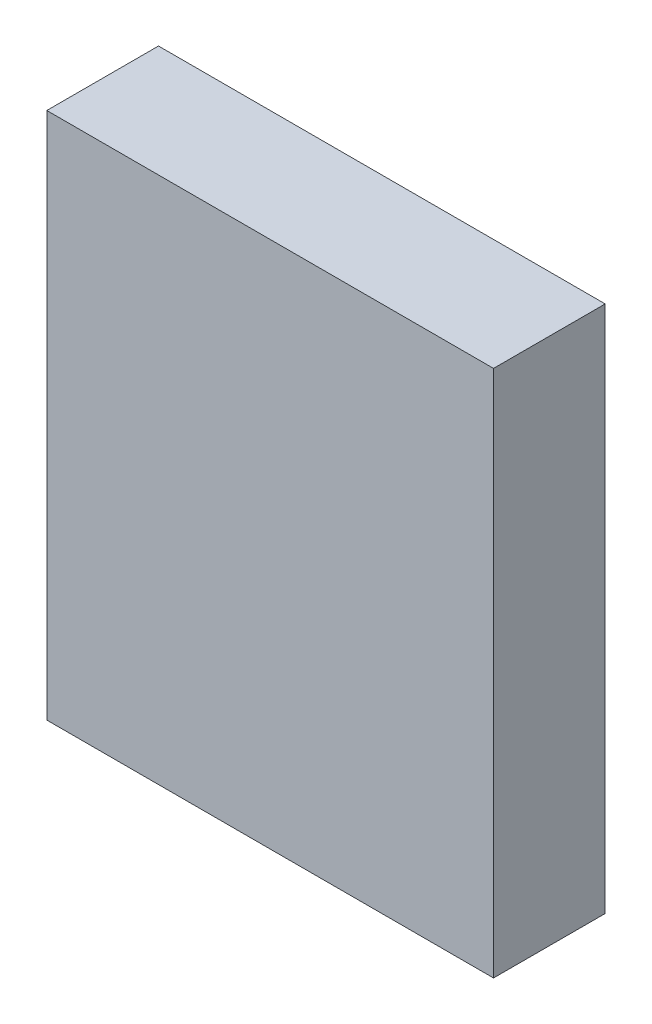
ISO-10303-21;
HEADER;
FILE_DESCRIPTION(('STEP AP214'),'2;1');
FILE_NAME('part.step','',(''),(''),'','','');
FILE_SCHEMA(('AUTOMOTIVE_DESIGN { 1 0 10303 214 1 1 1 1 }'));
ENDSEC;
DATA;
#1=APPLICATION_CONTEXT('core data for automotive mechanical design processes');
#2=APPLICATION_PROTOCOL_DEFINITION('international standard','automotive_design',2000,#1);
#3=PRODUCT_CONTEXT('',#1,'mechanical');
#4=PRODUCT('Part','Part','',(#3));
#5=PRODUCT_RELATED_PRODUCT_CATEGORY('part','',(#4));
#6=PRODUCT_DEFINITION_FORMATION('','',#4);
#7=PRODUCT_DEFINITION_CONTEXT('part definition',#1,'design');
#8=PRODUCT_DEFINITION('design','',#6,#7);
#9=PRODUCT_DEFINITION_SHAPE('','',#8);
#10=(LENGTH_UNIT() NAMED_UNIT(*) SI_UNIT(.MILLI.,.METRE.));
#11=(NAMED_UNIT(*) PLANE_ANGLE_UNIT() SI_UNIT($,.RADIAN.));
#12=(NAMED_UNIT(*) SI_UNIT($,.STERADIAN.) SOLID_ANGLE_UNIT());
#13=UNCERTAINTY_MEASURE_WITH_UNIT(LENGTH_MEASURE(1.E-05),#10,'distance_accuracy_value','');
#14=(GEOMETRIC_REPRESENTATION_CONTEXT(3) GLOBAL_UNCERTAINTY_ASSIGNED_CONTEXT((#13)) GLOBAL_UNIT_ASSIGNED_CONTEXT((#10,
#11,#12)) REPRESENTATION_CONTEXT('',''));
#15=CARTESIAN_POINT('',(0.,0.,0.));
#16=DIRECTION('',(0.,0.,1.));
#17=DIRECTION('',(1.,0.,0.));
#18=AXIS2_PLACEMENT_3D('',#15,#16,#17);
#19=CARTESIAN_POINT('',(0.,0.,11.));
#20=DIRECTION('',(1.,0.,0.));
#21=DIRECTION('',(0.,1.,0.));
#22=AXIS2_PLACEMENT_3D('',#19,#20,#21);
#23=PLANE('',#22);
#24=DIRECTION('',(0.,-1.,0.));
#25=VECTOR('',#24,1.);
#26=CARTESIAN_POINT('',(0.,0.,0.));
#27=LINE('',#26,#25);
#28=CARTESIAN_POINT('',(0.,52.,0.));
#29=VERTEX_POINT('',#28);
#30=CARTESIAN_POINT('',(0.,0.,0.));
#31=VERTEX_POINT('',#30);
#32=EDGE_CURVE('E96',#29,#31,#27,.T.);
#33=ORIENTED_EDGE('',*,*,#32,.T.);
#34=DIRECTION('',(0.,0.,-1.));
#35=VECTOR('',#34,1.);
#36=CARTESIAN_POINT('',(0.,0.,11.));
#37=LINE('',#36,#35);
#38=CARTESIAN_POINT('',(0.,0.,11.));
#39=VERTEX_POINT('',#38);
#40=EDGE_CURVE('E11',#39,#31,#37,.T.);
#41=ORIENTED_EDGE('',*,*,#40,.F.);
#42=DIRECTION('',(0.,-1.,0.));
#43=VECTOR('',#42,1.);
#44=CARTESIAN_POINT('',(0.,0.,11.));
#45=LINE('',#44,#43);
#46=CARTESIAN_POINT('',(0.,52.,11.));
#47=VERTEX_POINT('',#46);
#48=EDGE_CURVE('E84',#47,#39,#45,.T.);
#49=ORIENTED_EDGE('',*,*,#48,.F.);
#50=DIRECTION('',(0.,0.,-1.));
#51=VECTOR('',#50,1.);
#52=CARTESIAN_POINT('',(0.,52.,11.));
#53=LINE('',#52,#51);
#54=EDGE_CURVE('E92',#47,#29,#53,.T.);
#55=ORIENTED_EDGE('',*,*,#54,.T.);
#56=EDGE_LOOP('',(#33,#41,#49,#55));
#57=FACE_BOUND('',#56,.T.);
#58=ADVANCED_FACE('F33',(#57),#23,.F.);
#59=CARTESIAN_POINT('',(0.,0.,11.));
#60=DIRECTION('',(0.,1.,0.));
#61=DIRECTION('',(0.,0.,1.));
#62=AXIS2_PLACEMENT_3D('',#59,#60,#61);
#63=PLANE('',#62);
#64=DIRECTION('',(1.,0.,0.));
#65=VECTOR('',#64,1.);
#66=CARTESIAN_POINT('',(0.,0.,0.));
#67=LINE('',#66,#65);
#68=CARTESIAN_POINT('',(44.,0.,0.));
#69=VERTEX_POINT('',#68);
#70=EDGE_CURVE('E88',#31,#69,#67,.T.);
#71=ORIENTED_EDGE('',*,*,#70,.T.);
#72=DIRECTION('',(0.,0.,-1.));
#73=VECTOR('',#72,1.);
#74=CARTESIAN_POINT('',(44.,0.,11.));
#75=LINE('',#74,#73);
#76=CARTESIAN_POINT('',(44.,0.,11.));
#77=VERTEX_POINT('',#76);
#78=EDGE_CURVE('E41',#77,#69,#75,.T.);
#79=ORIENTED_EDGE('',*,*,#78,.F.);
#80=DIRECTION('',(1.,0.,0.));
#81=VECTOR('',#80,1.);
#82=CARTESIAN_POINT('',(0.,0.,11.));
#83=LINE('',#82,#81);
#84=EDGE_CURVE('E79',#39,#77,#83,.T.);
#85=ORIENTED_EDGE('',*,*,#84,.F.);
#86=ORIENTED_EDGE('',*,*,#40,.T.);
#87=EDGE_LOOP('',(#71,#79,#85,#86));
#88=FACE_BOUND('',#87,.T.);
#89=ADVANCED_FACE('F87',(#88),#63,.F.);
#90=CARTESIAN_POINT('',(44.,0.,11.));
#91=DIRECTION('',(-1.,0.,0.));
#92=DIRECTION('',(0.,-1.,0.));
#93=AXIS2_PLACEMENT_3D('',#90,#91,#92);
#94=PLANE('',#93);
#95=DIRECTION('',(0.,1.,0.));
#96=VECTOR('',#95,1.);
#97=CARTESIAN_POINT('',(44.,0.,0.));
#98=LINE('',#97,#96);
#99=CARTESIAN_POINT('',(44.,52.,0.));
#100=VERTEX_POINT('',#99);
#101=EDGE_CURVE('E66',#69,#100,#98,.T.);
#102=ORIENTED_EDGE('',*,*,#101,.T.);
#103=DIRECTION('',(0.,0.,-1.));
#104=VECTOR('',#103,1.);
#105=CARTESIAN_POINT('',(44.,52.,11.));
#106=LINE('',#105,#104);
#107=CARTESIAN_POINT('',(44.,52.,11.));
#108=VERTEX_POINT('',#107);
#109=EDGE_CURVE('E89',#108,#100,#106,.T.);
#110=ORIENTED_EDGE('',*,*,#109,.F.);
#111=DIRECTION('',(0.,1.,0.));
#112=VECTOR('',#111,1.);
#113=CARTESIAN_POINT('',(44.,0.,11.));
#114=LINE('',#113,#112);
#115=EDGE_CURVE('E82',#77,#108,#114,.T.);
#116=ORIENTED_EDGE('',*,*,#115,.F.);
#117=ORIENTED_EDGE('',*,*,#78,.T.);
#118=EDGE_LOOP('',(#102,#110,#116,#117));
#119=FACE_BOUND('',#118,.T.);
#120=ADVANCED_FACE('F90',(#119),#94,.F.);
#121=CARTESIAN_POINT('',(0.,52.,11.));
#122=DIRECTION('',(0.,-1.,0.));
#123=DIRECTION('',(0.,0.,-1.));
#124=AXIS2_PLACEMENT_3D('',#121,#122,#123);
#125=PLANE('',#124);
#126=DIRECTION('',(-1.,0.,0.));
#127=VECTOR('',#126,1.);
#128=CARTESIAN_POINT('',(0.,52.,0.));
#129=LINE('',#128,#127);
#130=EDGE_CURVE('E72',#100,#29,#129,.T.);
#131=ORIENTED_EDGE('',*,*,#130,.T.);
#132=ORIENTED_EDGE('',*,*,#54,.F.);
#133=DIRECTION('',(-1.,0.,0.));
#134=VECTOR('',#133,1.);
#135=CARTESIAN_POINT('',(0.,52.,11.));
#136=LINE('',#135,#134);
#137=EDGE_CURVE('E49',#108,#47,#136,.T.);
#138=ORIENTED_EDGE('',*,*,#137,.F.);
#139=ORIENTED_EDGE('',*,*,#109,.T.);
#140=EDGE_LOOP('',(#131,#132,#138,#139));
#141=FACE_BOUND('',#140,.T.);
#142=ADVANCED_FACE('F103',(#141),#125,.F.);
#143=CARTESIAN_POINT('',(0.,0.,11.));
#144=DIRECTION('',(0.,0.,-1.));
#145=DIRECTION('',(-1.,0.,0.));
#146=AXIS2_PLACEMENT_3D('',#143,#144,#145);
#147=PLANE('',#146);
#148=ORIENTED_EDGE('',*,*,#48,.T.);
#149=ORIENTED_EDGE('',*,*,#84,.T.);
#150=ORIENTED_EDGE('',*,*,#115,.T.);
#151=ORIENTED_EDGE('',*,*,#137,.T.);
#152=EDGE_LOOP('',(#148,#149,#150,#151));
#153=FACE_BOUND('',#152,.T.);
#154=ADVANCED_FACE('F80',(#153),#147,.F.);
#155=CARTESIAN_POINT('',(0.,0.,0.));
#156=DIRECTION('',(0.,0.,-1.));
#157=DIRECTION('',(-1.,0.,0.));
#158=AXIS2_PLACEMENT_3D('',#155,#156,#157);
#159=PLANE('',#158);
#160=ORIENTED_EDGE('',*,*,#32,.F.);
#161=ORIENTED_EDGE('',*,*,#130,.F.);
#162=ORIENTED_EDGE('',*,*,#101,.F.);
#163=ORIENTED_EDGE('',*,*,#70,.F.);
#164=EDGE_LOOP('',(#160,#161,#162,#163));
#165=FACE_BOUND('',#164,.T.);
#166=ADVANCED_FACE('F106',(#165),#159,.T.);
#167=CLOSED_SHELL('',(#58,#89,#120,#142,#154,#166));
#168=MANIFOLD_SOLID_BREP('B2',#167);
#169=ADVANCED_BREP_SHAPE_REPRESENTATION('',(#18,#168),#14);
#170=SHAPE_DEFINITION_REPRESENTATION(#9,#169);
ENDSEC;
END-ISO-10303-21;
